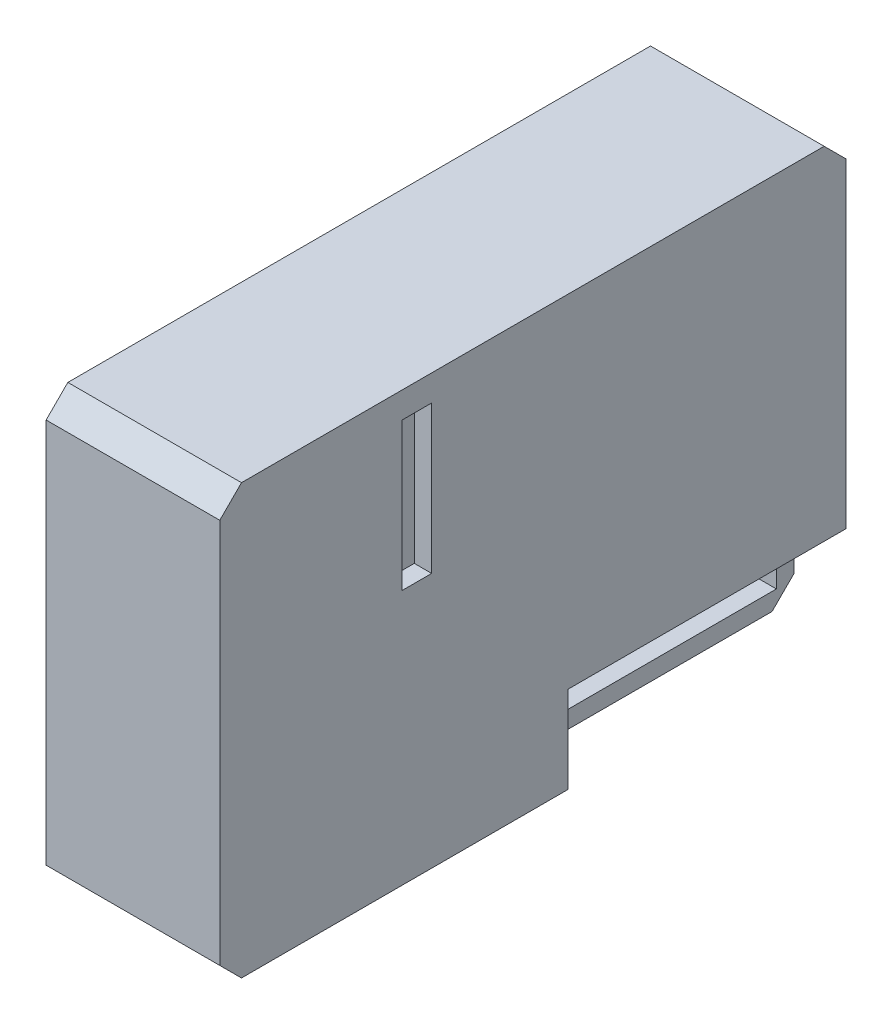
ISO-10303-21;
HEADER;
FILE_DESCRIPTION(('STEP AP214'),'2;1');
FILE_NAME('part.step','',(''),(''),'','','');
FILE_SCHEMA(('AUTOMOTIVE_DESIGN { 1 0 10303 214 1 1 1 1 }'));
ENDSEC;
DATA;
#1=APPLICATION_CONTEXT('core data for automotive mechanical design processes');
#2=APPLICATION_PROTOCOL_DEFINITION('international standard','automotive_design',2000,#1);
#3=PRODUCT_CONTEXT('',#1,'mechanical');
#4=PRODUCT('Part','Part','',(#3));
#5=PRODUCT_RELATED_PRODUCT_CATEGORY('part','',(#4));
#6=PRODUCT_DEFINITION_FORMATION('','',#4);
#7=PRODUCT_DEFINITION_CONTEXT('part definition',#1,'design');
#8=PRODUCT_DEFINITION('design','',#6,#7);
#9=PRODUCT_DEFINITION_SHAPE('','',#8);
#10=(LENGTH_UNIT() NAMED_UNIT(*) SI_UNIT(.MILLI.,.METRE.));
#11=(NAMED_UNIT(*) PLANE_ANGLE_UNIT() SI_UNIT($,.RADIAN.));
#12=(NAMED_UNIT(*) SI_UNIT($,.STERADIAN.) SOLID_ANGLE_UNIT());
#13=UNCERTAINTY_MEASURE_WITH_UNIT(LENGTH_MEASURE(1.E-05),#10,'distance_accuracy_value','');
#14=(GEOMETRIC_REPRESENTATION_CONTEXT(3) GLOBAL_UNCERTAINTY_ASSIGNED_CONTEXT((#13)) GLOBAL_UNIT_ASSIGNED_CONTEXT((#10,
#11,#12)) REPRESENTATION_CONTEXT('',''));
#15=CARTESIAN_POINT('',(0.,0.,0.));
#16=DIRECTION('',(0.,0.,1.));
#17=DIRECTION('',(1.,0.,0.));
#18=AXIS2_PLACEMENT_3D('',#15,#16,#17);
#19=CARTESIAN_POINT('',(0.,-24.2678113704429,0.));
#20=DIRECTION('',(1.,0.,0.));
#21=DIRECTION('',(0.,0.,-1.));
#22=AXIS2_PLACEMENT_3D('',#19,#20,#21);
#23=PLANE('',#22);
#24=DIRECTION('',(0.,0.,1.));
#25=VECTOR('',#24,1.);
#26=CARTESIAN_POINT('',(0.,38.4701886295571,0.));
#27=LINE('',#26,#25);
#28=CARTESIAN_POINT('',(0.,38.4701886295571,3.17500000000001));
#29=VERTEX_POINT('',#28);
#30=CARTESIAN_POINT('',(0.,38.4701886295571,88.392));
#31=VERTEX_POINT('',#30);
#32=EDGE_CURVE('E257',#29,#31,#27,.T.);
#33=ORIENTED_EDGE('',*,*,#32,.F.);
#34=DIRECTION('',(0.,0.707106781186546,0.707106781186549));
#35=VECTOR('',#34,1.);
#36=CARTESIAN_POINT('',(0.,35.2951886295571,0.));
#37=LINE('',#36,#35);
#38=CARTESIAN_POINT('',(0.,35.2951886295571,0.));
#39=VERTEX_POINT('',#38);
#40=EDGE_CURVE('E322',#29,#39,#37,.F.);
#41=ORIENTED_EDGE('',*,*,#40,.T.);
#42=DIRECTION('',(0.,1.,0.));
#43=VECTOR('',#42,1.);
#44=CARTESIAN_POINT('',(0.,-24.2678113704429,0.));
#45=LINE('',#44,#43);
#46=CARTESIAN_POINT('',(0.,-21.0928113704429,0.));
#47=VERTEX_POINT('',#46);
#48=EDGE_CURVE('E253',#47,#39,#45,.T.);
#49=ORIENTED_EDGE('',*,*,#48,.F.);
#50=DIRECTION('',(0.,0.707106781186549,-0.707106781186546));
#51=VECTOR('',#50,1.);
#52=CARTESIAN_POINT('',(0.,-24.2678113704429,3.175));
#53=LINE('',#52,#51);
#54=CARTESIAN_POINT('',(0.,-24.2678113704429,3.17500000000001));
#55=VERTEX_POINT('',#54);
#56=EDGE_CURVE('E320',#47,#55,#53,.F.);
#57=ORIENTED_EDGE('',*,*,#56,.T.);
#58=DIRECTION('',(0.,0.,-1.));
#59=VECTOR('',#58,1.);
#60=CARTESIAN_POINT('',(0.,-24.2678113704429,91.567));
#61=LINE('',#60,#59);
#62=CARTESIAN_POINT('',(0.,-24.2678113704429,88.392));
#63=VERTEX_POINT('',#62);
#64=EDGE_CURVE('E263',#63,#55,#61,.T.);
#65=ORIENTED_EDGE('',*,*,#64,.F.);
#66=DIRECTION('',(0.,-0.707106781186546,-0.707106781186549));
#67=VECTOR('',#66,1.);
#68=CARTESIAN_POINT('',(0.,-21.0928113704429,91.567));
#69=LINE('',#68,#67);
#70=CARTESIAN_POINT('',(0.,-21.0928113704429,91.567));
#71=VERTEX_POINT('',#70);
#72=EDGE_CURVE('E318',#63,#71,#69,.F.);
#73=ORIENTED_EDGE('',*,*,#72,.T.);
#74=DIRECTION('',(0.,-1.,0.));
#75=VECTOR('',#74,1.);
#76=CARTESIAN_POINT('',(0.,38.4701886295571,91.567));
#77=LINE('',#76,#75);
#78=CARTESIAN_POINT('',(0.,35.2951886295571,91.567));
#79=VERTEX_POINT('',#78);
#80=EDGE_CURVE('E260',#79,#71,#77,.T.);
#81=ORIENTED_EDGE('',*,*,#80,.F.);
#82=DIRECTION('',(0.,-0.707106781186549,0.707106781186546));
#83=VECTOR('',#82,1.);
#84=CARTESIAN_POINT('',(0.,38.4701886295571,88.392));
#85=LINE('',#84,#83);
#86=EDGE_CURVE('E316',#79,#31,#85,.F.);
#87=ORIENTED_EDGE('',*,*,#86,.T.);
#88=EDGE_LOOP('',(#33,#41,#49,#57,#65,#73,#81,#87));
#89=FACE_BOUND('',#88,.T.);
#90=ADVANCED_FACE('F39',(#89),#23,.F.);
#91=CARTESIAN_POINT('',(0.,-24.2678113704429,91.567));
#92=DIRECTION('',(0.,-1.,0.));
#93=DIRECTION('',(0.,0.,-1.));
#94=AXIS2_PLACEMENT_3D('',#91,#92,#93);
#95=PLANE('',#94);
#96=DIRECTION('',(1.,0.,0.));
#97=VECTOR('',#96,1.);
#98=CARTESIAN_POINT('',(17.78,-24.2678113704429,40.64));
#99=LINE('',#98,#97);
#100=CARTESIAN_POINT('',(17.78,-24.2678113704429,40.64));
#101=VERTEX_POINT('',#100);
#102=CARTESIAN_POINT('',(25.4,-24.2678113704429,40.64));
#103=VERTEX_POINT('',#102);
#104=EDGE_CURVE('E221',#101,#103,#99,.T.);
#105=ORIENTED_EDGE('',*,*,#104,.T.);
#106=DIRECTION('',(0.,0.,1.));
#107=VECTOR('',#106,1.);
#108=CARTESIAN_POINT('',(25.4,-24.2678113704429,0.));
#109=LINE('',#108,#107);
#110=CARTESIAN_POINT('',(25.4,-24.2678113704429,88.392));
#111=VERTEX_POINT('',#110);
#112=EDGE_CURVE('E248',#103,#111,#109,.T.);
#113=ORIENTED_EDGE('',*,*,#112,.T.);
#114=DIRECTION('',(-1.,0.,0.));
#115=VECTOR('',#114,1.);
#116=CARTESIAN_POINT('',(0.,-24.2678113704429,88.392));
#117=LINE('',#116,#115);
#118=EDGE_CURVE('E324',#111,#63,#117,.T.);
#119=ORIENTED_EDGE('',*,*,#118,.T.);
#120=ORIENTED_EDGE('',*,*,#64,.T.);
#121=DIRECTION('',(1.,0.,0.));
#122=VECTOR('',#121,1.);
#123=CARTESIAN_POINT('',(0.,-24.2678113704429,3.175));
#124=LINE('',#123,#122);
#125=CARTESIAN_POINT('',(17.78,-24.2678113704429,3.175));
#126=VERTEX_POINT('',#125);
#127=EDGE_CURVE('E326',#55,#126,#124,.T.);
#128=ORIENTED_EDGE('',*,*,#127,.T.);
#129=DIRECTION('',(0.,0.,-1.));
#130=VECTOR('',#129,1.);
#131=CARTESIAN_POINT('',(17.78,-24.2678113704429,-15.8897507027405));
#132=LINE('',#131,#130);
#133=EDGE_CURVE('E215',#101,#126,#132,.T.);
#134=ORIENTED_EDGE('',*,*,#133,.F.);
#135=EDGE_LOOP('',(#105,#113,#119,#120,#128,#134));
#136=FACE_BOUND('',#135,.T.);
#137=ADVANCED_FACE('F379',(#136),#95,.T.);
#138=CARTESIAN_POINT('',(0.,38.4701886295571,91.567));
#139=DIRECTION('',(0.,0.,1.));
#140=DIRECTION('',(1.,0.,0.));
#141=AXIS2_PLACEMENT_3D('',#138,#139,#140);
#142=PLANE('',#141);
#143=ORIENTED_EDGE('',*,*,#80,.T.);
#144=DIRECTION('',(1.,0.,0.));
#145=VECTOR('',#144,1.);
#146=CARTESIAN_POINT('',(0.,-21.0928113704429,91.567));
#147=LINE('',#146,#145);
#148=CARTESIAN_POINT('',(25.4,-21.0928113704428,91.567));
#149=VERTEX_POINT('',#148);
#150=EDGE_CURVE('E331',#71,#149,#147,.T.);
#151=ORIENTED_EDGE('',*,*,#150,.T.);
#152=DIRECTION('',(0.,-1.,0.));
#153=VECTOR('',#152,1.);
#154=CARTESIAN_POINT('',(25.4,-24.2678113704429,91.567));
#155=LINE('',#154,#153);
#156=CARTESIAN_POINT('',(25.4,35.2951886295571,91.567));
#157=VERTEX_POINT('',#156);
#158=EDGE_CURVE('E251',#157,#149,#155,.T.);
#159=ORIENTED_EDGE('',*,*,#158,.F.);
#160=DIRECTION('',(-1.,0.,0.));
#161=VECTOR('',#160,1.);
#162=CARTESIAN_POINT('',(0.,35.2951886295571,91.567));
#163=LINE('',#162,#161);
#164=EDGE_CURVE('E329',#157,#79,#163,.T.);
#165=ORIENTED_EDGE('',*,*,#164,.T.);
#166=EDGE_LOOP('',(#143,#151,#159,#165));
#167=FACE_BOUND('',#166,.T.);
#168=ADVANCED_FACE('F389',(#167),#142,.T.);
#169=CARTESIAN_POINT('',(0.,38.4701886295571,0.));
#170=DIRECTION('',(0.,1.,0.));
#171=DIRECTION('',(0.,0.,1.));
#172=AXIS2_PLACEMENT_3D('',#169,#170,#171);
#173=PLANE('',#172);
#174=DIRECTION('',(0.,0.,1.));
#175=VECTOR('',#174,1.);
#176=CARTESIAN_POINT('',(25.4,38.4701886295571,0.));
#177=LINE('',#176,#175);
#178=CARTESIAN_POINT('',(25.4,38.4701886295571,3.17500000000001));
#179=VERTEX_POINT('',#178);
#180=CARTESIAN_POINT('',(25.4,38.4701886295571,88.392));
#181=VERTEX_POINT('',#180);
#182=EDGE_CURVE('E247',#179,#181,#177,.T.);
#183=ORIENTED_EDGE('',*,*,#182,.F.);
#184=DIRECTION('',(-1.,0.,0.));
#185=VECTOR('',#184,1.);
#186=CARTESIAN_POINT('',(0.,38.4701886295571,3.17500000000001));
#187=LINE('',#186,#185);
#188=EDGE_CURVE('E314',#179,#29,#187,.T.);
#189=ORIENTED_EDGE('',*,*,#188,.T.);
#190=ORIENTED_EDGE('',*,*,#32,.T.);
#191=DIRECTION('',(1.,0.,0.));
#192=VECTOR('',#191,1.);
#193=CARTESIAN_POINT('',(0.,38.4701886295571,88.392));
#194=LINE('',#193,#192);
#195=EDGE_CURVE('E311',#31,#181,#194,.T.);
#196=ORIENTED_EDGE('',*,*,#195,.T.);
#197=EDGE_LOOP('',(#183,#189,#190,#196));
#198=FACE_BOUND('',#197,.T.);
#199=ADVANCED_FACE('F397',(#198),#173,.T.);
#200=CARTESIAN_POINT('',(0.,-24.2678113704429,0.));
#201=DIRECTION('',(0.,0.,-1.));
#202=DIRECTION('',(-1.,0.,0.));
#203=AXIS2_PLACEMENT_3D('',#200,#201,#202);
#204=PLANE('',#203);
#205=DIRECTION('',(1.,0.,0.));
#206=VECTOR('',#205,1.);
#207=CARTESIAN_POINT('',(0.,-11.5678113704429,0.));
#208=LINE('',#207,#206);
#209=CARTESIAN_POINT('',(17.78,-11.5678113704429,0.));
#210=VERTEX_POINT('',#209);
#211=CARTESIAN_POINT('',(25.4,-11.5678113704429,0.));
#212=VERTEX_POINT('',#211);
#213=EDGE_CURVE('E232',#210,#212,#208,.T.);
#214=ORIENTED_EDGE('',*,*,#213,.F.);
#215=DIRECTION('',(0.,1.,0.));
#216=VECTOR('',#215,1.);
#217=CARTESIAN_POINT('',(17.78,-24.2678113704429,0.));
#218=LINE('',#217,#216);
#219=CARTESIAN_POINT('',(17.78,-21.0928113704429,0.));
#220=VERTEX_POINT('',#219);
#221=EDGE_CURVE('E242',#220,#210,#218,.T.);
#222=ORIENTED_EDGE('',*,*,#221,.F.);
#223=DIRECTION('',(-1.,0.,0.));
#224=VECTOR('',#223,1.);
#225=CARTESIAN_POINT('',(0.,-21.0928113704429,0.));
#226=LINE('',#225,#224);
#227=EDGE_CURVE('E256',#220,#47,#226,.T.);
#228=ORIENTED_EDGE('',*,*,#227,.T.);
#229=ORIENTED_EDGE('',*,*,#48,.T.);
#230=DIRECTION('',(1.,0.,0.));
#231=VECTOR('',#230,1.);
#232=CARTESIAN_POINT('',(0.,35.2951886295571,0.));
#233=LINE('',#232,#231);
#234=CARTESIAN_POINT('',(25.4,35.2951886295571,0.));
#235=VERTEX_POINT('',#234);
#236=EDGE_CURVE('E301',#39,#235,#233,.T.);
#237=ORIENTED_EDGE('',*,*,#236,.T.);
#238=DIRECTION('',(0.,1.,0.));
#239=VECTOR('',#238,1.);
#240=CARTESIAN_POINT('',(25.4,-24.2678113704429,0.));
#241=LINE('',#240,#239);
#242=EDGE_CURVE('E245',#212,#235,#241,.T.);
#243=ORIENTED_EDGE('',*,*,#242,.F.);
#244=EDGE_LOOP('',(#214,#222,#228,#229,#237,#243));
#245=FACE_BOUND('',#244,.T.);
#246=ADVANCED_FACE('F367',(#245),#204,.T.);
#247=CARTESIAN_POINT('',(25.4,-24.2678113704429,0.));
#248=DIRECTION('',(1.,0.,0.));
#249=DIRECTION('',(0.,0.,-1.));
#250=AXIS2_PLACEMENT_3D('',#247,#248,#249);
#251=PLANE('',#250);
#252=DIRECTION('',(0.,0.,1.));
#253=VECTOR('',#252,1.);
#254=CARTESIAN_POINT('',(25.4,34.6601886295571,64.897));
#255=LINE('',#254,#253);
#256=CARTESIAN_POINT('',(25.4,34.6601886295571,60.579));
#257=VERTEX_POINT('',#256);
#258=CARTESIAN_POINT('',(25.4,34.6601886295571,64.897));
#259=VERTEX_POINT('',#258);
#260=EDGE_CURVE('E184',#257,#259,#255,.T.);
#261=ORIENTED_EDGE('',*,*,#260,.F.);
#262=DIRECTION('',(0.,1.,0.));
#263=VECTOR('',#262,1.);
#264=CARTESIAN_POINT('',(25.4,13.0701886295571,60.579));
#265=LINE('',#264,#263);
#266=CARTESIAN_POINT('',(25.4,13.0701886295571,60.579));
#267=VERTEX_POINT('',#266);
#268=EDGE_CURVE('E192',#267,#257,#265,.T.);
#269=ORIENTED_EDGE('',*,*,#268,.F.);
#270=DIRECTION('',(0.,0.,-1.));
#271=VECTOR('',#270,1.);
#272=CARTESIAN_POINT('',(25.4,13.0701886295571,64.897));
#273=LINE('',#272,#271);
#274=CARTESIAN_POINT('',(25.4,13.0701886295571,64.897));
#275=VERTEX_POINT('',#274);
#276=EDGE_CURVE('E54',#275,#267,#273,.T.);
#277=ORIENTED_EDGE('',*,*,#276,.F.);
#278=DIRECTION('',(0.,-1.,0.));
#279=VECTOR('',#278,1.);
#280=CARTESIAN_POINT('',(25.4,13.0701886295571,64.897));
#281=LINE('',#280,#279);
#282=EDGE_CURVE('E201',#259,#275,#281,.T.);
#283=ORIENTED_EDGE('',*,*,#282,.F.);
#284=EDGE_LOOP('',(#261,#269,#277,#283));
#285=FACE_BOUND('',#284,.T.);
#286=DIRECTION('',(0.,-1.,0.));
#287=VECTOR('',#286,1.);
#288=CARTESIAN_POINT('',(25.4,-11.5678113704429,40.64));
#289=LINE('',#288,#287);
#290=CARTESIAN_POINT('',(25.4,-11.5678113704429,40.64));
#291=VERTEX_POINT('',#290);
#292=EDGE_CURVE('E212',#291,#103,#289,.T.);
#293=ORIENTED_EDGE('',*,*,#292,.F.);
#294=DIRECTION('',(0.,0.,1.));
#295=VECTOR('',#294,1.);
#296=CARTESIAN_POINT('',(25.4,-11.5678113704429,-15.8897507027405));
#297=LINE('',#296,#295);
#298=EDGE_CURVE('E216',#212,#291,#297,.T.);
#299=ORIENTED_EDGE('',*,*,#298,.F.);
#300=ORIENTED_EDGE('',*,*,#242,.T.);
#301=DIRECTION('',(0.,-0.707106781186546,-0.707106781186549));
#302=VECTOR('',#301,1.);
#303=CARTESIAN_POINT('',(25.4,5.51368862955726,-29.7815));
#304=LINE('',#303,#302);
#305=EDGE_CURVE('E309',#235,#179,#304,.F.);
#306=ORIENTED_EDGE('',*,*,#305,.T.);
#307=ORIENTED_EDGE('',*,*,#182,.T.);
#308=DIRECTION('',(0.,0.707106781186549,-0.707106781186546));
#309=VECTOR('',#308,1.);
#310=CARTESIAN_POINT('',(25.4,51.297188629557,75.5650000000002));
#311=LINE('',#310,#309);
#312=EDGE_CURVE('E304',#181,#157,#311,.F.);
#313=ORIENTED_EDGE('',*,*,#312,.T.);
#314=ORIENTED_EDGE('',*,*,#158,.T.);
#315=DIRECTION('',(0.,0.707106781186546,0.707106781186549));
#316=VECTOR('',#315,1.);
#317=CARTESIAN_POINT('',(25.4,-68.4638113704429,44.1959999999998));
#318=LINE('',#317,#316);
#319=EDGE_CURVE('E306',#149,#111,#318,.F.);
#320=ORIENTED_EDGE('',*,*,#319,.T.);
#321=ORIENTED_EDGE('',*,*,#112,.F.);
#322=EDGE_LOOP('',(#293,#299,#300,#306,#307,#313,#314,#320,#321));
#323=FACE_BOUND('',#322,.T.);
#324=ADVANCED_FACE('F198',(#285,#323),#251,.T.);
#325=CARTESIAN_POINT('',(0.,35.2951886295571,0.));
#326=DIRECTION('',(0.,-0.707106781186549,0.707106781186546));
#327=DIRECTION('',(1.,0.,0.));
#328=AXIS2_PLACEMENT_3D('',#325,#326,#327);
#329=PLANE('',#328);
#330=ORIENTED_EDGE('',*,*,#40,.F.);
#331=ORIENTED_EDGE('',*,*,#188,.F.);
#332=ORIENTED_EDGE('',*,*,#305,.F.);
#333=ORIENTED_EDGE('',*,*,#236,.F.);
#334=EDGE_LOOP('',(#330,#331,#332,#333));
#335=FACE_BOUND('',#334,.T.);
#336=ADVANCED_FACE('F401',(#335),#329,.F.);
#337=CARTESIAN_POINT('',(0.,-24.2678113704429,3.175));
#338=DIRECTION('',(0.,0.707106781186546,0.707106781186549));
#339=DIRECTION('',(1.,0.,0.));
#340=AXIS2_PLACEMENT_3D('',#337,#338,#339);
#341=PLANE('',#340);
#342=DIRECTION('',(0.,-0.707106781186549,0.707106781186546));
#343=VECTOR('',#342,1.);
#344=CARTESIAN_POINT('',(17.78,-24.2678113704429,3.175));
#345=LINE('',#344,#343);
#346=EDGE_CURVE('E240',#126,#220,#345,.F.);
#347=ORIENTED_EDGE('',*,*,#346,.F.);
#348=ORIENTED_EDGE('',*,*,#127,.F.);
#349=ORIENTED_EDGE('',*,*,#56,.F.);
#350=ORIENTED_EDGE('',*,*,#227,.F.);
#351=EDGE_LOOP('',(#347,#348,#349,#350));
#352=FACE_BOUND('',#351,.T.);
#353=ADVANCED_FACE('F372',(#352),#341,.F.);
#354=CARTESIAN_POINT('',(0.,-21.0928113704429,91.567));
#355=DIRECTION('',(0.,0.707106781186549,-0.707106781186546));
#356=DIRECTION('',(1.,0.,0.));
#357=AXIS2_PLACEMENT_3D('',#354,#355,#356);
#358=PLANE('',#357);
#359=ORIENTED_EDGE('',*,*,#72,.F.);
#360=ORIENTED_EDGE('',*,*,#118,.F.);
#361=ORIENTED_EDGE('',*,*,#319,.F.);
#362=ORIENTED_EDGE('',*,*,#150,.F.);
#363=EDGE_LOOP('',(#359,#360,#361,#362));
#364=FACE_BOUND('',#363,.T.);
#365=ADVANCED_FACE('F384',(#364),#358,.F.);
#366=CARTESIAN_POINT('',(0.,38.4701886295571,88.392));
#367=DIRECTION('',(0.,-0.707106781186546,-0.707106781186549));
#368=DIRECTION('',(1.,0.,0.));
#369=AXIS2_PLACEMENT_3D('',#366,#367,#368);
#370=PLANE('',#369);
#371=ORIENTED_EDGE('',*,*,#86,.F.);
#372=ORIENTED_EDGE('',*,*,#164,.F.);
#373=ORIENTED_EDGE('',*,*,#312,.F.);
#374=ORIENTED_EDGE('',*,*,#195,.F.);
#375=EDGE_LOOP('',(#371,#372,#373,#374));
#376=FACE_BOUND('',#375,.T.);
#377=ADVANCED_FACE('F41',(#376),#370,.F.);
#378=CARTESIAN_POINT('',(17.78,0.,0.));
#379=DIRECTION('',(-1.,0.,0.));
#380=DIRECTION('',(0.,0.,1.));
#381=AXIS2_PLACEMENT_3D('',#378,#379,#380);
#382=PLANE('',#381);
#383=ORIENTED_EDGE('',*,*,#221,.T.);
#384=DIRECTION('',(0.,0.,1.));
#385=VECTOR('',#384,1.);
#386=CARTESIAN_POINT('',(17.78,-11.5678113704429,-15.8897507027405));
#387=LINE('',#386,#385);
#388=CARTESIAN_POINT('',(17.78,-11.5678113704429,2.53999999999999));
#389=VERTEX_POINT('',#388);
#390=EDGE_CURVE('E218',#210,#389,#387,.T.);
#391=ORIENTED_EDGE('',*,*,#390,.T.);
#392=DIRECTION('',(0.,1.,0.));
#393=VECTOR('',#392,1.);
#394=CARTESIAN_POINT('',(17.78,-24.2678113704429,2.54));
#395=LINE('',#394,#393);
#396=CARTESIAN_POINT('',(17.78,-21.7278113704429,2.54));
#397=VERTEX_POINT('',#396);
#398=EDGE_CURVE('E11',#397,#389,#395,.T.);
#399=ORIENTED_EDGE('',*,*,#398,.F.);
#400=DIRECTION('',(0.,0.,-1.));
#401=VECTOR('',#400,1.);
#402=CARTESIAN_POINT('',(17.78,-21.7278113704429,91.567));
#403=LINE('',#402,#401);
#404=CARTESIAN_POINT('',(17.78,-21.7278113704429,40.64));
#405=VERTEX_POINT('',#404);
#406=EDGE_CURVE('E237',#405,#397,#403,.T.);
#407=ORIENTED_EDGE('',*,*,#406,.F.);
#408=DIRECTION('',(0.,-1.,0.));
#409=VECTOR('',#408,1.);
#410=CARTESIAN_POINT('',(17.78,-11.5678113704429,40.64));
#411=LINE('',#410,#409);
#412=EDGE_CURVE('E213',#405,#101,#411,.T.);
#413=ORIENTED_EDGE('',*,*,#412,.T.);
#414=ORIENTED_EDGE('',*,*,#133,.T.);
#415=ORIENTED_EDGE('',*,*,#346,.T.);
#416=EDGE_LOOP('',(#383,#391,#399,#407,#413,#414,#415));
#417=FACE_BOUND('',#416,.T.);
#418=ADVANCED_FACE('F362',(#417),#382,.F.);
#419=CARTESIAN_POINT('',(17.78,-11.5678113704429,40.64));
#420=DIRECTION('',(0.,0.,1.));
#421=DIRECTION('',(0.,-1.,0.));
#422=AXIS2_PLACEMENT_3D('',#419,#420,#421);
#423=PLANE('',#422);
#424=DIRECTION('',(0.,-1.,0.));
#425=VECTOR('',#424,1.);
#426=CARTESIAN_POINT('',(22.86,-24.2678113704429,40.64));
#427=LINE('',#426,#425);
#428=CARTESIAN_POINT('',(22.86,-11.5678113704429,40.64));
#429=VERTEX_POINT('',#428);
#430=CARTESIAN_POINT('',(22.86,-21.7278113704429,40.64));
#431=VERTEX_POINT('',#430);
#432=EDGE_CURVE('E47',#429,#431,#427,.T.);
#433=ORIENTED_EDGE('',*,*,#432,.F.);
#434=DIRECTION('',(1.,0.,0.));
#435=VECTOR('',#434,1.);
#436=CARTESIAN_POINT('',(17.78,-11.5678113704429,40.64));
#437=LINE('',#436,#435);
#438=EDGE_CURVE('E225',#429,#291,#437,.T.);
#439=ORIENTED_EDGE('',*,*,#438,.T.);
#440=ORIENTED_EDGE('',*,*,#292,.T.);
#441=ORIENTED_EDGE('',*,*,#104,.F.);
#442=ORIENTED_EDGE('',*,*,#412,.F.);
#443=DIRECTION('',(-1.,0.,0.));
#444=VECTOR('',#443,1.);
#445=CARTESIAN_POINT('',(0.,-21.7278113704429,40.64));
#446=LINE('',#445,#444);
#447=EDGE_CURVE('E234',#431,#405,#446,.T.);
#448=ORIENTED_EDGE('',*,*,#447,.F.);
#449=EDGE_LOOP('',(#433,#439,#440,#441,#442,#448));
#450=FACE_BOUND('',#449,.T.);
#451=ADVANCED_FACE('F405',(#450),#423,.F.);
#452=CARTESIAN_POINT('',(17.78,-11.5678113704429,-15.8897507027405));
#453=DIRECTION('',(0.,1.,0.));
#454=DIRECTION('',(0.,0.,1.));
#455=AXIS2_PLACEMENT_3D('',#452,#453,#454);
#456=PLANE('',#455);
#457=ORIENTED_EDGE('',*,*,#213,.T.);
#458=ORIENTED_EDGE('',*,*,#298,.T.);
#459=ORIENTED_EDGE('',*,*,#438,.F.);
#460=DIRECTION('',(0.,0.,1.));
#461=VECTOR('',#460,1.);
#462=CARTESIAN_POINT('',(22.86,-11.5678113704429,0.));
#463=LINE('',#462,#461);
#464=CARTESIAN_POINT('',(22.86,-11.5678113704429,2.54));
#465=VERTEX_POINT('',#464);
#466=EDGE_CURVE('E334',#465,#429,#463,.T.);
#467=ORIENTED_EDGE('',*,*,#466,.F.);
#468=DIRECTION('',(1.,0.,0.));
#469=VECTOR('',#468,1.);
#470=CARTESIAN_POINT('',(0.,-11.5678113704429,2.54));
#471=LINE('',#470,#469);
#472=EDGE_CURVE('E227',#389,#465,#471,.T.);
#473=ORIENTED_EDGE('',*,*,#472,.F.);
#474=ORIENTED_EDGE('',*,*,#390,.F.);
#475=EDGE_LOOP('',(#457,#458,#459,#467,#473,#474));
#476=FACE_BOUND('',#475,.T.);
#477=ADVANCED_FACE('F359',(#476),#456,.F.);
#478=CARTESIAN_POINT('',(2.54,-24.2678113704429,0.));
#479=DIRECTION('',(1.,0.,0.));
#480=DIRECTION('',(0.,0.,-1.));
#481=AXIS2_PLACEMENT_3D('',#478,#479,#480);
#482=PLANE('',#481);
#483=DIRECTION('',(0.,-1.,0.));
#484=VECTOR('',#483,1.);
#485=CARTESIAN_POINT('',(2.54,-24.2678113704429,89.027));
#486=LINE('',#485,#484);
#487=CARTESIAN_POINT('',(2.54,35.9301886295571,89.027));
#488=VERTEX_POINT('',#487);
#489=CARTESIAN_POINT('',(2.54,-21.7278113704429,89.027));
#490=VERTEX_POINT('',#489);
#491=EDGE_CURVE('E269',#488,#490,#486,.T.);
#492=ORIENTED_EDGE('',*,*,#491,.T.);
#493=DIRECTION('',(0.,0.,-1.));
#494=VECTOR('',#493,1.);
#495=CARTESIAN_POINT('',(2.54,-21.7278113704429,0.));
#496=LINE('',#495,#494);
#497=CARTESIAN_POINT('',(2.54,-21.7278113704429,2.54));
#498=VERTEX_POINT('',#497);
#499=EDGE_CURVE('E281',#490,#498,#496,.T.);
#500=ORIENTED_EDGE('',*,*,#499,.T.);
#501=DIRECTION('',(0.,1.,0.));
#502=VECTOR('',#501,1.);
#503=CARTESIAN_POINT('',(2.54,-24.2678113704429,2.54));
#504=LINE('',#503,#502);
#505=CARTESIAN_POINT('',(2.54,35.9301886295571,2.54));
#506=VERTEX_POINT('',#505);
#507=EDGE_CURVE('E277',#498,#506,#504,.T.);
#508=ORIENTED_EDGE('',*,*,#507,.T.);
#509=DIRECTION('',(0.,0.,1.));
#510=VECTOR('',#509,1.);
#511=CARTESIAN_POINT('',(2.54,35.9301886295571,0.));
#512=LINE('',#511,#510);
#513=EDGE_CURVE('E274',#506,#488,#512,.T.);
#514=ORIENTED_EDGE('',*,*,#513,.T.);
#515=EDGE_LOOP('',(#492,#500,#508,#514));
#516=FACE_BOUND('',#515,.T.);
#517=ADVANCED_FACE('F414',(#516),#482,.T.);
#518=CARTESIAN_POINT('',(0.,-21.7278113704429,91.567));
#519=DIRECTION('',(0.,-1.,0.));
#520=DIRECTION('',(0.,0.,-1.));
#521=AXIS2_PLACEMENT_3D('',#518,#519,#520);
#522=PLANE('',#521);
#523=DIRECTION('',(0.,0.,1.));
#524=VECTOR('',#523,1.);
#525=CARTESIAN_POINT('',(22.86,-21.7278113704429,91.567));
#526=LINE('',#525,#524);
#527=CARTESIAN_POINT('',(22.86,-21.7278113704429,89.027));
#528=VERTEX_POINT('',#527);
#529=EDGE_CURVE('E280',#431,#528,#526,.T.);
#530=ORIENTED_EDGE('',*,*,#529,.F.);
#531=ORIENTED_EDGE('',*,*,#447,.T.);
#532=ORIENTED_EDGE('',*,*,#406,.T.);
#533=DIRECTION('',(1.,0.,0.));
#534=VECTOR('',#533,1.);
#535=CARTESIAN_POINT('',(0.,-21.7278113704429,2.54));
#536=LINE('',#535,#534);
#537=EDGE_CURVE('E284',#498,#397,#536,.T.);
#538=ORIENTED_EDGE('',*,*,#537,.F.);
#539=ORIENTED_EDGE('',*,*,#499,.F.);
#540=DIRECTION('',(1.,0.,0.));
#541=VECTOR('',#540,1.);
#542=CARTESIAN_POINT('',(0.,-21.7278113704429,89.027));
#543=LINE('',#542,#541);
#544=EDGE_CURVE('E244',#490,#528,#543,.T.);
#545=ORIENTED_EDGE('',*,*,#544,.T.);
#546=EDGE_LOOP('',(#530,#531,#532,#538,#539,#545));
#547=FACE_BOUND('',#546,.T.);
#548=ADVANCED_FACE('F345',(#547),#522,.F.);
#549=CARTESIAN_POINT('',(0.,38.4701886295571,89.027));
#550=DIRECTION('',(0.,0.,1.));
#551=DIRECTION('',(1.,0.,0.));
#552=AXIS2_PLACEMENT_3D('',#549,#550,#551);
#553=PLANE('',#552);
#554=DIRECTION('',(0.,-1.,0.));
#555=VECTOR('',#554,1.);
#556=CARTESIAN_POINT('',(22.86,-24.2678113704429,89.027));
#557=LINE('',#556,#555);
#558=CARTESIAN_POINT('',(22.86,35.9301886295571,89.027));
#559=VERTEX_POINT('',#558);
#560=EDGE_CURVE('E266',#559,#528,#557,.T.);
#561=ORIENTED_EDGE('',*,*,#560,.T.);
#562=ORIENTED_EDGE('',*,*,#544,.F.);
#563=ORIENTED_EDGE('',*,*,#491,.F.);
#564=DIRECTION('',(1.,0.,0.));
#565=VECTOR('',#564,1.);
#566=CARTESIAN_POINT('',(0.,35.9301886295571,89.027));
#567=LINE('',#566,#565);
#568=EDGE_CURVE('E273',#488,#559,#567,.T.);
#569=ORIENTED_EDGE('',*,*,#568,.T.);
#570=EDGE_LOOP('',(#561,#562,#563,#569));
#571=FACE_BOUND('',#570,.T.);
#572=ADVANCED_FACE('F349',(#571),#553,.F.);
#573=CARTESIAN_POINT('',(0.,35.9301886295571,0.));
#574=DIRECTION('',(0.,1.,0.));
#575=DIRECTION('',(0.,0.,1.));
#576=AXIS2_PLACEMENT_3D('',#573,#574,#575);
#577=PLANE('',#576);
#578=DIRECTION('',(0.,0.,1.));
#579=VECTOR('',#578,1.);
#580=CARTESIAN_POINT('',(22.86,35.9301886295571,0.));
#581=LINE('',#580,#579);
#582=CARTESIAN_POINT('',(22.86,35.9301886295571,2.54));
#583=VERTEX_POINT('',#582);
#584=EDGE_CURVE('E293',#583,#559,#581,.T.);
#585=ORIENTED_EDGE('',*,*,#584,.T.);
#586=ORIENTED_EDGE('',*,*,#568,.F.);
#587=ORIENTED_EDGE('',*,*,#513,.F.);
#588=DIRECTION('',(1.,0.,0.));
#589=VECTOR('',#588,1.);
#590=CARTESIAN_POINT('',(0.,35.9301886295571,2.54));
#591=LINE('',#590,#589);
#592=EDGE_CURVE('E272',#506,#583,#591,.T.);
#593=ORIENTED_EDGE('',*,*,#592,.T.);
#594=EDGE_LOOP('',(#585,#586,#587,#593));
#595=FACE_BOUND('',#594,.T.);
#596=ADVANCED_FACE('F352',(#595),#577,.F.);
#597=CARTESIAN_POINT('',(0.,-24.2678113704429,2.54));
#598=DIRECTION('',(0.,0.,-1.));
#599=DIRECTION('',(-1.,0.,0.));
#600=AXIS2_PLACEMENT_3D('',#597,#598,#599);
#601=PLANE('',#600);
#602=ORIENTED_EDGE('',*,*,#398,.T.);
#603=ORIENTED_EDGE('',*,*,#472,.T.);
#604=DIRECTION('',(0.,1.,0.));
#605=VECTOR('',#604,1.);
#606=CARTESIAN_POINT('',(22.86,-24.2678113704429,2.54));
#607=LINE('',#606,#605);
#608=EDGE_CURVE('E286',#465,#583,#607,.T.);
#609=ORIENTED_EDGE('',*,*,#608,.T.);
#610=ORIENTED_EDGE('',*,*,#592,.F.);
#611=ORIENTED_EDGE('',*,*,#507,.F.);
#612=ORIENTED_EDGE('',*,*,#537,.T.);
#613=EDGE_LOOP('',(#602,#603,#609,#610,#611,#612));
#614=FACE_BOUND('',#613,.T.);
#615=ADVANCED_FACE('F356',(#614),#601,.F.);
#616=CARTESIAN_POINT('',(22.86,-24.2678113704429,0.));
#617=DIRECTION('',(1.,0.,0.));
#618=DIRECTION('',(0.,0.,-1.));
#619=AXIS2_PLACEMENT_3D('',#616,#617,#618);
#620=PLANE('',#619);
#621=DIRECTION('',(0.,-1.,0.));
#622=VECTOR('',#621,1.);
#623=CARTESIAN_POINT('',(22.86,13.0701886295571,60.579));
#624=LINE('',#623,#622);
#625=CARTESIAN_POINT('',(22.86,34.6601886295571,60.579));
#626=VERTEX_POINT('',#625);
#627=CARTESIAN_POINT('',(22.86,13.0701886295571,60.579));
#628=VERTEX_POINT('',#627);
#629=EDGE_CURVE('E196',#626,#628,#624,.T.);
#630=ORIENTED_EDGE('',*,*,#629,.F.);
#631=DIRECTION('',(0.,0.,-1.));
#632=VECTOR('',#631,1.);
#633=CARTESIAN_POINT('',(22.86,34.6601886295571,64.897));
#634=LINE('',#633,#632);
#635=CARTESIAN_POINT('',(22.86,34.6601886295571,64.897));
#636=VERTEX_POINT('',#635);
#637=EDGE_CURVE('E62',#636,#626,#634,.T.);
#638=ORIENTED_EDGE('',*,*,#637,.F.);
#639=DIRECTION('',(0.,1.,0.));
#640=VECTOR('',#639,1.);
#641=CARTESIAN_POINT('',(22.86,13.0701886295571,64.897));
#642=LINE('',#641,#640);
#643=CARTESIAN_POINT('',(22.86,13.0701886295571,64.897));
#644=VERTEX_POINT('',#643);
#645=EDGE_CURVE('E548',#644,#636,#642,.T.);
#646=ORIENTED_EDGE('',*,*,#645,.F.);
#647=DIRECTION('',(0.,0.,1.));
#648=VECTOR('',#647,1.);
#649=CARTESIAN_POINT('',(22.86,13.0701886295571,64.897));
#650=LINE('',#649,#648);
#651=EDGE_CURVE('E546',#628,#644,#650,.T.);
#652=ORIENTED_EDGE('',*,*,#651,.F.);
#653=EDGE_LOOP('',(#630,#638,#646,#652));
#654=FACE_BOUND('',#653,.T.);
#655=ORIENTED_EDGE('',*,*,#466,.T.);
#656=ORIENTED_EDGE('',*,*,#432,.T.);
#657=ORIENTED_EDGE('',*,*,#529,.T.);
#658=ORIENTED_EDGE('',*,*,#560,.F.);
#659=ORIENTED_EDGE('',*,*,#584,.F.);
#660=ORIENTED_EDGE('',*,*,#608,.F.);
#661=EDGE_LOOP('',(#655,#656,#657,#658,#659,#660));
#662=FACE_BOUND('',#661,.T.);
#663=ADVANCED_FACE('F340',(#654,#662),#620,.F.);
#664=CARTESIAN_POINT('',(-0.001000000000001,34.6601886295571,64.897));
#665=DIRECTION('',(0.,1.,0.));
#666=DIRECTION('',(0.,0.,1.));
#667=AXIS2_PLACEMENT_3D('',#664,#665,#666);
#668=PLANE('',#667);
#669=ORIENTED_EDGE('',*,*,#637,.T.);
#670=DIRECTION('',(1.,0.,0.));
#671=VECTOR('',#670,1.);
#672=CARTESIAN_POINT('',(-0.001000000000001,34.6601886295571,60.579));
#673=LINE('',#672,#671);
#674=EDGE_CURVE('E180',#626,#257,#673,.T.);
#675=ORIENTED_EDGE('',*,*,#674,.T.);
#676=ORIENTED_EDGE('',*,*,#260,.T.);
#677=DIRECTION('',(1.,0.,0.));
#678=VECTOR('',#677,1.);
#679=CARTESIAN_POINT('',(-0.001000000000001,34.6601886295571,64.897));
#680=LINE('',#679,#678);
#681=EDGE_CURVE('E189',#636,#259,#680,.T.);
#682=ORIENTED_EDGE('',*,*,#681,.F.);
#683=EDGE_LOOP('',(#669,#675,#676,#682));
#684=FACE_BOUND('',#683,.T.);
#685=ADVANCED_FACE('F182',(#684),#668,.F.);
#686=CARTESIAN_POINT('',(-0.001000000000001,13.0701886295571,64.897));
#687=DIRECTION('',(0.,0.,1.));
#688=DIRECTION('',(1.,0.,0.));
#689=AXIS2_PLACEMENT_3D('',#686,#687,#688);
#690=PLANE('',#689);
#691=ORIENTED_EDGE('',*,*,#645,.T.);
#692=ORIENTED_EDGE('',*,*,#681,.T.);
#693=ORIENTED_EDGE('',*,*,#282,.T.);
#694=DIRECTION('',(1.,0.,0.));
#695=VECTOR('',#694,1.);
#696=CARTESIAN_POINT('',(-0.001000000000001,13.0701886295571,64.897));
#697=LINE('',#696,#695);
#698=EDGE_CURVE('E208',#644,#275,#697,.T.);
#699=ORIENTED_EDGE('',*,*,#698,.F.);
#700=EDGE_LOOP('',(#691,#692,#693,#699));
#701=FACE_BOUND('',#700,.T.);
#702=ADVANCED_FACE('F514',(#701),#690,.F.);
#703=CARTESIAN_POINT('',(-0.001000000000001,13.0701886295571,64.897));
#704=DIRECTION('',(0.,-1.,0.));
#705=DIRECTION('',(0.,0.,-1.));
#706=AXIS2_PLACEMENT_3D('',#703,#704,#705);
#707=PLANE('',#706);
#708=ORIENTED_EDGE('',*,*,#651,.T.);
#709=ORIENTED_EDGE('',*,*,#698,.T.);
#710=ORIENTED_EDGE('',*,*,#276,.T.);
#711=DIRECTION('',(1.,0.,0.));
#712=VECTOR('',#711,1.);
#713=CARTESIAN_POINT('',(-0.001000000000001,13.0701886295571,60.579));
#714=LINE('',#713,#712);
#715=EDGE_CURVE('E194',#628,#267,#714,.T.);
#716=ORIENTED_EDGE('',*,*,#715,.F.);
#717=EDGE_LOOP('',(#708,#709,#710,#716));
#718=FACE_BOUND('',#717,.T.);
#719=ADVANCED_FACE('F523',(#718),#707,.F.);
#720=CARTESIAN_POINT('',(-0.001000000000001,13.0701886295571,60.579));
#721=DIRECTION('',(0.,0.,-1.));
#722=DIRECTION('',(-1.,0.,0.));
#723=AXIS2_PLACEMENT_3D('',#720,#721,#722);
#724=PLANE('',#723);
#725=ORIENTED_EDGE('',*,*,#629,.T.);
#726=ORIENTED_EDGE('',*,*,#715,.T.);
#727=ORIENTED_EDGE('',*,*,#268,.T.);
#728=ORIENTED_EDGE('',*,*,#674,.F.);
#729=EDGE_LOOP('',(#725,#726,#727,#728));
#730=FACE_BOUND('',#729,.T.);
#731=ADVANCED_FACE('F193',(#730),#724,.F.);
#732=CLOSED_SHELL('',(#90,#137,#168,#199,#246,#324,#336,#353,#365,#377,#418,#451,#477,#517,#548,
#572,#596,#615,#663,#685,#702,#719,#731));
#733=MANIFOLD_SOLID_BREP('B2',#732);
#734=ADVANCED_BREP_SHAPE_REPRESENTATION('',(#18,#733),#14);
#735=SHAPE_DEFINITION_REPRESENTATION(#9,#734);
ENDSEC;
END-ISO-10303-21;
